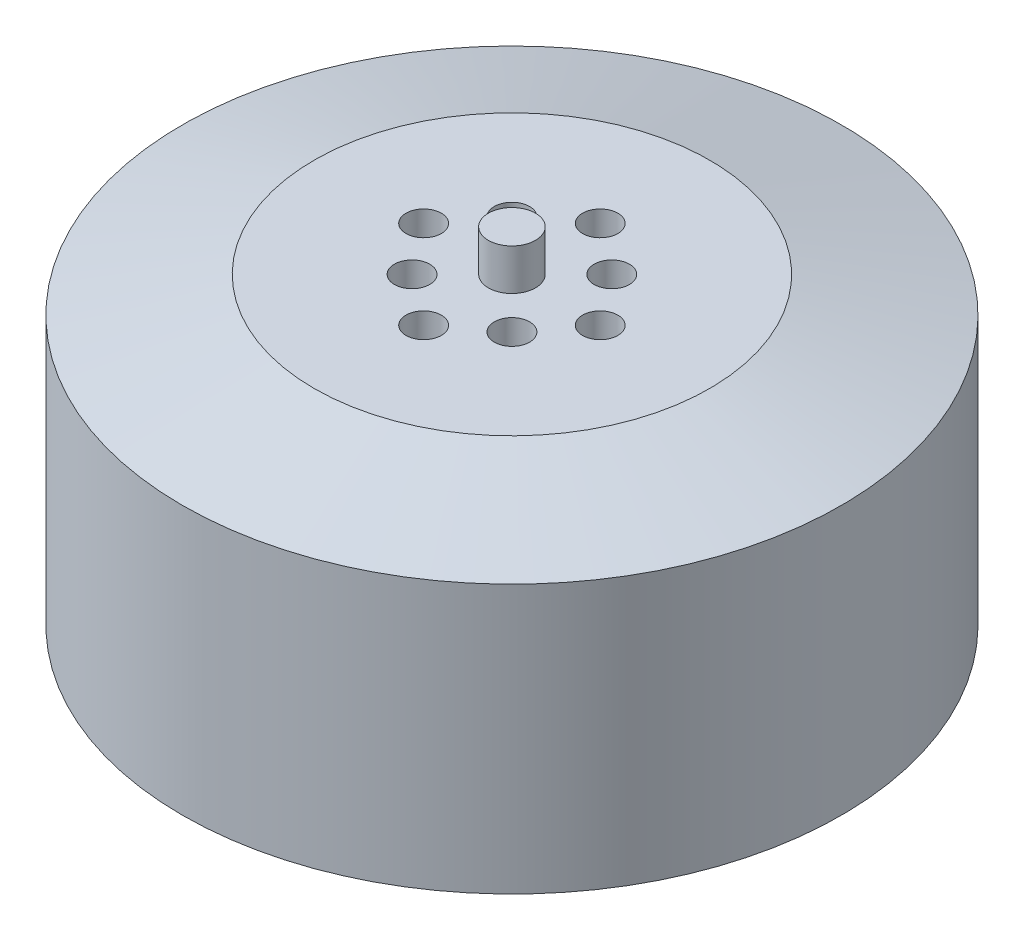
ISO-10303-21;
HEADER;
FILE_DESCRIPTION(('STEP AP214'),'2;1');
FILE_NAME('part.step','',(''),(''),'','','');
FILE_SCHEMA(('AUTOMOTIVE_DESIGN { 1 0 10303 214 1 1 1 1 }'));
ENDSEC;
DATA;
#1=APPLICATION_CONTEXT('core data for automotive mechanical design processes');
#2=APPLICATION_PROTOCOL_DEFINITION('international standard','automotive_design',2000,#1);
#3=PRODUCT_CONTEXT('',#1,'mechanical');
#4=PRODUCT('Part','Part','',(#3));
#5=PRODUCT_RELATED_PRODUCT_CATEGORY('part','',(#4));
#6=PRODUCT_DEFINITION_FORMATION('','',#4);
#7=PRODUCT_DEFINITION_CONTEXT('part definition',#1,'design');
#8=PRODUCT_DEFINITION('design','',#6,#7);
#9=PRODUCT_DEFINITION_SHAPE('','',#8);
#10=(LENGTH_UNIT() NAMED_UNIT(*) SI_UNIT(.MILLI.,.METRE.));
#11=(NAMED_UNIT(*) PLANE_ANGLE_UNIT() SI_UNIT($,.RADIAN.));
#12=(NAMED_UNIT(*) SI_UNIT($,.STERADIAN.) SOLID_ANGLE_UNIT());
#13=UNCERTAINTY_MEASURE_WITH_UNIT(LENGTH_MEASURE(1.E-05),#10,'distance_accuracy_value','');
#14=(GEOMETRIC_REPRESENTATION_CONTEXT(3) GLOBAL_UNCERTAINTY_ASSIGNED_CONTEXT((#13)) GLOBAL_UNIT_ASSIGNED_CONTEXT((#10,
#11,#12)) REPRESENTATION_CONTEXT('',''));
#15=CARTESIAN_POINT('',(0.,0.,0.));
#16=DIRECTION('',(0.,0.,1.));
#17=DIRECTION('',(1.,0.,0.));
#18=AXIS2_PLACEMENT_3D('',#15,#16,#17);
#19=CARTESIAN_POINT('',(0.,25.8,0.));
#20=DIRECTION('',(0.,-1.,0.));
#21=DIRECTION('',(0.,0.,-1.));
#22=AXIS2_PLACEMENT_3D('',#19,#20,#21);
#23=CYLINDRICAL_SURFACE('',#22,28.);
#24=CARTESIAN_POINT('',(0.,22.8,0.));
#25=DIRECTION('',(0.,1.,0.));
#26=DIRECTION('',(0.,0.,1.));
#27=AXIS2_PLACEMENT_3D('',#24,#25,#26);
#28=CIRCLE('',#27,28.);
#29=CARTESIAN_POINT('',(0.,22.8,28.));
#30=VERTEX_POINT('',#29);
#31=EDGE_CURVE('E10',#30,#30,#28,.F.);
#32=ORIENTED_EDGE('',*,*,#31,.T.);
#33=EDGE_LOOP('',(#32));
#34=FACE_BOUND('',#33,.T.);
#35=CARTESIAN_POINT('',(0.,0.,0.));
#36=DIRECTION('',(0.,1.,0.));
#37=DIRECTION('',(0.,0.,1.));
#38=AXIS2_PLACEMENT_3D('',#35,#36,#37);
#39=CIRCLE('',#38,28.);
#40=CARTESIAN_POINT('',(0.,0.,28.));
#41=VERTEX_POINT('',#40);
#42=EDGE_CURVE('E43',#41,#41,#39,.T.);
#43=ORIENTED_EDGE('',*,*,#42,.T.);
#44=EDGE_LOOP('',(#43));
#45=FACE_BOUND('',#44,.T.);
#46=ADVANCED_FACE('F32',(#34,#45),#23,.T.);
#47=CARTESIAN_POINT('',(0.,25.8,0.));
#48=DIRECTION('',(0.,1.,0.));
#49=DIRECTION('',(0.,0.,1.));
#50=AXIS2_PLACEMENT_3D('',#47,#48,#49);
#51=PLANE('',#50);
#52=CARTESIAN_POINT('',(0.,25.8,0.));
#53=DIRECTION('',(0.,1.,0.));
#54=DIRECTION('',(0.,0.,1.));
#55=AXIS2_PLACEMENT_3D('',#52,#53,#54);
#56=CIRCLE('',#55,16.8038475772934);
#57=CARTESIAN_POINT('',(0.,25.8,16.8038475772934));
#58=VERTEX_POINT('',#57);
#59=EDGE_CURVE('E39',#58,#58,#56,.T.);
#60=ORIENTED_EDGE('',*,*,#59,.T.);
#61=EDGE_LOOP('',(#60));
#62=FACE_BOUND('',#61,.T.);
#63=CARTESIAN_POINT('',(-7.5,25.8,0.));
#64=DIRECTION('',(0.,1.,0.));
#65=DIRECTION('',(0.,0.,1.));
#66=AXIS2_PLACEMENT_3D('',#63,#64,#65);
#67=CIRCLE('',#66,1.50000000000008);
#68=CARTESIAN_POINT('',(-7.5,25.8,1.50000000000008));
#69=VERTEX_POINT('',#68);
#70=EDGE_CURVE('E111',#69,#69,#67,.T.);
#71=ORIENTED_EDGE('',*,*,#70,.F.);
#72=EDGE_LOOP('',(#71));
#73=FACE_BOUND('',#72,.T.);
#74=CARTESIAN_POINT('',(4.24264068711953,25.8,4.24264068711928));
#75=DIRECTION('',(0.,1.,0.));
#76=DIRECTION('',(0.,0.,1.));
#77=AXIS2_PLACEMENT_3D('',#74,#75,#76);
#78=CIRCLE('',#77,1.49999999999994);
#79=CARTESIAN_POINT('',(4.24264068711953,25.8,5.74264068711922));
#80=VERTEX_POINT('',#79);
#81=EDGE_CURVE('E104',#80,#80,#78,.T.);
#82=ORIENTED_EDGE('',*,*,#81,.F.);
#83=EDGE_LOOP('',(#82));
#84=FACE_BOUND('',#83,.T.);
#85=CARTESIAN_POINT('',(-4.24264068711904,25.8,4.24264068711953));
#86=DIRECTION('',(0.,1.,0.));
#87=DIRECTION('',(0.,0.,1.));
#88=AXIS2_PLACEMENT_3D('',#85,#86,#87);
#89=CIRCLE('',#88,1.50000000000017);
#90=CARTESIAN_POINT('',(-4.24264068711904,25.8,5.7426406871197));
#91=VERTEX_POINT('',#90);
#92=EDGE_CURVE('E122',#91,#91,#89,.T.);
#93=ORIENTED_EDGE('',*,*,#92,.F.);
#94=EDGE_LOOP('',(#93));
#95=FACE_BOUND('',#94,.T.);
#96=CARTESIAN_POINT('',(-4.2426406871193,25.8,-4.24264068711904));
#97=DIRECTION('',(0.,1.,0.));
#98=DIRECTION('',(0.,0.,1.));
#99=AXIS2_PLACEMENT_3D('',#96,#97,#98);
#100=CIRCLE('',#99,1.50000000000025);
#101=CARTESIAN_POINT('',(-4.2426406871193,25.8,-2.74264068711879));
#102=VERTEX_POINT('',#101);
#103=EDGE_CURVE('E116',#102,#102,#100,.T.);
#104=ORIENTED_EDGE('',*,*,#103,.F.);
#105=EDGE_LOOP('',(#104));
#106=FACE_BOUND('',#105,.T.);
#107=CARTESIAN_POINT('',(0.,25.8,7.5));
#108=DIRECTION('',(0.,1.,0.));
#109=DIRECTION('',(0.,0.,1.));
#110=AXIS2_PLACEMENT_3D('',#107,#108,#109);
#111=CIRCLE('',#110,1.50000000000005);
#112=CARTESIAN_POINT('',(0.,25.8,9.00000000000005));
#113=VERTEX_POINT('',#112);
#114=EDGE_CURVE('E86',#113,#113,#111,.T.);
#115=ORIENTED_EDGE('',*,*,#114,.F.);
#116=EDGE_LOOP('',(#115));
#117=FACE_BOUND('',#116,.T.);
#118=CARTESIAN_POINT('',(7.5,25.8,0.));
#119=DIRECTION('',(0.,1.,0.));
#120=DIRECTION('',(0.,0.,1.));
#121=AXIS2_PLACEMENT_3D('',#118,#119,#120);
#122=CIRCLE('',#121,1.50000000000002);
#123=CARTESIAN_POINT('',(7.5,25.8,1.50000000000002));
#124=VERTEX_POINT('',#123);
#125=EDGE_CURVE('E93',#124,#124,#122,.T.);
#126=ORIENTED_EDGE('',*,*,#125,.F.);
#127=EDGE_LOOP('',(#126));
#128=FACE_BOUND('',#127,.T.);
#129=CARTESIAN_POINT('',(4.24264068711928,25.8,-4.24264068711929));
#130=DIRECTION('',(0.,1.,0.));
#131=DIRECTION('',(0.,0.,1.));
#132=AXIS2_PLACEMENT_3D('',#129,#130,#131);
#133=CIRCLE('',#132,1.5);
#134=CARTESIAN_POINT('',(4.24264068711928,25.8,-2.74264068711929));
#135=VERTEX_POINT('',#134);
#136=EDGE_CURVE('E99',#135,#135,#133,.T.);
#137=ORIENTED_EDGE('',*,*,#136,.F.);
#138=EDGE_LOOP('',(#137));
#139=FACE_BOUND('',#138,.T.);
#140=CARTESIAN_POINT('',(0.,25.8,-7.5));
#141=DIRECTION('',(0.,1.,0.));
#142=DIRECTION('',(0.,0.,1.));
#143=AXIS2_PLACEMENT_3D('',#140,#141,#142);
#144=CIRCLE('',#143,1.5);
#145=CARTESIAN_POINT('',(0.,25.8,-6.));
#146=VERTEX_POINT('',#145);
#147=EDGE_CURVE('E80',#146,#146,#144,.T.);
#148=ORIENTED_EDGE('',*,*,#147,.F.);
#149=EDGE_LOOP('',(#148));
#150=FACE_BOUND('',#149,.T.);
#151=CARTESIAN_POINT('',(0.,25.8,0.));
#152=DIRECTION('',(0.,1.,0.));
#153=DIRECTION('',(0.,0.,1.));
#154=AXIS2_PLACEMENT_3D('',#151,#152,#153);
#155=CIRCLE('',#154,2.);
#156=CARTESIAN_POINT('',(0.,25.8,2.));
#157=VERTEX_POINT('',#156);
#158=EDGE_CURVE('E50',#157,#157,#155,.T.);
#159=ORIENTED_EDGE('',*,*,#158,.F.);
#160=EDGE_LOOP('',(#159));
#161=FACE_BOUND('',#160,.T.);
#162=ADVANCED_FACE('F137',(#62,#73,#84,#95,#106,#117,#128,#139,#150,#161),#51,.T.);
#163=CARTESIAN_POINT('',(0.,0.,0.));
#164=DIRECTION('',(0.,1.,0.));
#165=DIRECTION('',(0.,0.,1.));
#166=AXIS2_PLACEMENT_3D('',#163,#164,#165);
#167=PLANE('',#166);
#168=CARTESIAN_POINT('',(15.0000000000004,0.,4.24488671257339E-13));
#169=DIRECTION('',(0.,-1.,0.));
#170=DIRECTION('',(0.,0.,-1.));
#171=AXIS2_PLACEMENT_3D('',#168,#169,#170);
#172=CIRCLE('',#171,1.50000000000033);
#173=CARTESIAN_POINT('',(15.0000000000004,0.,-1.49999999999991));
#174=VERTEX_POINT('',#173);
#175=EDGE_CURVE('E75',#174,#174,#172,.T.);
#176=ORIENTED_EDGE('',*,*,#175,.F.);
#177=EDGE_LOOP('',(#176));
#178=FACE_BOUND('',#177,.T.);
#179=CARTESIAN_POINT('',(8.48977342514678E-13,0.,-15.));
#180=DIRECTION('',(0.,-1.,0.));
#181=DIRECTION('',(0.,0.,-1.));
#182=AXIS2_PLACEMENT_3D('',#179,#180,#181);
#183=CIRCLE('',#182,1.50000000000091);
#184=CARTESIAN_POINT('',(8.48977342514678E-13,0.,-16.5000000000009));
#185=VERTEX_POINT('',#184);
#186=EDGE_CURVE('E69',#185,#185,#183,.T.);
#187=ORIENTED_EDGE('',*,*,#186,.F.);
#188=EDGE_LOOP('',(#187));
#189=FACE_BOUND('',#188,.T.);
#190=CARTESIAN_POINT('',(-14.9999999999996,0.,-4.2632564145606E-13));
#191=DIRECTION('',(0.,-1.,0.));
#192=DIRECTION('',(0.,0.,-1.));
#193=AXIS2_PLACEMENT_3D('',#190,#191,#192);
#194=CIRCLE('',#193,1.50000000000068);
#195=CARTESIAN_POINT('',(-14.9999999999996,0.,-1.50000000000111));
#196=VERTEX_POINT('',#195);
#197=EDGE_CURVE('E62',#196,#196,#194,.T.);
#198=ORIENTED_EDGE('',*,*,#197,.F.);
#199=EDGE_LOOP('',(#198));
#200=FACE_BOUND('',#199,.T.);
#201=CARTESIAN_POINT('',(0.,0.,15.));
#202=DIRECTION('',(0.,-1.,0.));
#203=DIRECTION('',(0.,0.,-1.));
#204=AXIS2_PLACEMENT_3D('',#201,#202,#203);
#205=CIRCLE('',#204,1.5);
#206=CARTESIAN_POINT('',(0.,0.,13.5));
#207=VERTEX_POINT('',#206);
#208=EDGE_CURVE('E56',#207,#207,#205,.T.);
#209=ORIENTED_EDGE('',*,*,#208,.F.);
#210=EDGE_LOOP('',(#209));
#211=FACE_BOUND('',#210,.T.);
#212=ORIENTED_EDGE('',*,*,#42,.F.);
#213=EDGE_LOOP('',(#212));
#214=FACE_BOUND('',#213,.T.);
#215=ADVANCED_FACE('F140',(#178,#189,#200,#211,#214),#167,.F.);
#216=CARTESIAN_POINT('',(0.,29.3,0.));
#217=DIRECTION('',(0.,-1.,0.));
#218=DIRECTION('',(0.,0.,-1.));
#219=AXIS2_PLACEMENT_3D('',#216,#217,#218);
#220=CYLINDRICAL_SURFACE('',#219,2.);
#221=CARTESIAN_POINT('',(0.,29.3,0.));
#222=DIRECTION('',(0.,1.,0.));
#223=DIRECTION('',(0.,0.,1.));
#224=AXIS2_PLACEMENT_3D('',#221,#222,#223);
#225=CIRCLE('',#224,2.);
#226=CARTESIAN_POINT('',(0.,29.3,2.));
#227=VERTEX_POINT('',#226);
#228=EDGE_CURVE('E47',#227,#227,#225,.T.);
#229=ORIENTED_EDGE('',*,*,#228,.F.);
#230=EDGE_LOOP('',(#229));
#231=FACE_BOUND('',#230,.T.);
#232=ORIENTED_EDGE('',*,*,#158,.T.);
#233=EDGE_LOOP('',(#232));
#234=FACE_BOUND('',#233,.T.);
#235=ADVANCED_FACE('F154',(#231,#234),#220,.T.);
#236=CARTESIAN_POINT('',(0.,29.3,0.));
#237=DIRECTION('',(0.,1.,0.));
#238=DIRECTION('',(0.,0.,1.));
#239=AXIS2_PLACEMENT_3D('',#236,#237,#238);
#240=PLANE('',#239);
#241=ORIENTED_EDGE('',*,*,#228,.T.);
#242=EDGE_LOOP('',(#241));
#243=FACE_BOUND('',#242,.T.);
#244=ADVANCED_FACE('F156',(#243),#240,.T.);
#245=CARTESIAN_POINT('',(0.,3.,15.));
#246=DIRECTION('',(0.,-1.,0.));
#247=DIRECTION('',(0.,0.,-1.));
#248=AXIS2_PLACEMENT_3D('',#245,#246,#247);
#249=CYLINDRICAL_SURFACE('',#248,1.5);
#250=CARTESIAN_POINT('',(0.,3.,15.));
#251=DIRECTION('',(0.,-1.,0.));
#252=DIRECTION('',(0.,0.,-1.));
#253=AXIS2_PLACEMENT_3D('',#250,#251,#252);
#254=CIRCLE('',#253,1.5);
#255=CARTESIAN_POINT('',(0.,3.,13.5));
#256=VERTEX_POINT('',#255);
#257=EDGE_CURVE('E53',#256,#256,#254,.T.);
#258=ORIENTED_EDGE('',*,*,#257,.F.);
#259=EDGE_LOOP('',(#258));
#260=FACE_BOUND('',#259,.T.);
#261=ORIENTED_EDGE('',*,*,#208,.T.);
#262=EDGE_LOOP('',(#261));
#263=FACE_BOUND('',#262,.T.);
#264=ADVANCED_FACE('F163',(#260,#263),#249,.F.);
#265=CARTESIAN_POINT('',(0.,3.,15.));
#266=DIRECTION('',(0.,-1.,0.));
#267=DIRECTION('',(0.,0.,-1.));
#268=AXIS2_PLACEMENT_3D('',#265,#266,#267);
#269=PLANE('',#268);
#270=ORIENTED_EDGE('',*,*,#257,.T.);
#271=EDGE_LOOP('',(#270));
#272=FACE_BOUND('',#271,.T.);
#273=ADVANCED_FACE('F198',(#272),#269,.T.);
#274=CARTESIAN_POINT('',(-14.9999999999996,3.,-4.2632564145606E-13));
#275=DIRECTION('',(0.,-1.,0.));
#276=DIRECTION('',(0.,0.,-1.));
#277=AXIS2_PLACEMENT_3D('',#274,#275,#276);
#278=CYLINDRICAL_SURFACE('',#277,1.50000000000068);
#279=CARTESIAN_POINT('',(-14.9999999999996,3.,-4.2632564145606E-13));
#280=DIRECTION('',(0.,-1.,0.));
#281=DIRECTION('',(0.,0.,-1.));
#282=AXIS2_PLACEMENT_3D('',#279,#280,#281);
#283=CIRCLE('',#282,1.50000000000068);
#284=CARTESIAN_POINT('',(-14.9999999999996,3.,-1.50000000000111));
#285=VERTEX_POINT('',#284);
#286=EDGE_CURVE('E65',#285,#285,#283,.T.);
#287=ORIENTED_EDGE('',*,*,#286,.F.);
#288=EDGE_LOOP('',(#287));
#289=FACE_BOUND('',#288,.T.);
#290=ORIENTED_EDGE('',*,*,#197,.T.);
#291=EDGE_LOOP('',(#290));
#292=FACE_BOUND('',#291,.T.);
#293=ADVANCED_FACE('F208',(#289,#292),#278,.F.);
#294=CARTESIAN_POINT('',(-14.9999999999996,3.,-4.2632564145606E-13));
#295=DIRECTION('',(0.,-1.,0.));
#296=DIRECTION('',(0.,0.,-1.));
#297=AXIS2_PLACEMENT_3D('',#294,#295,#296);
#298=PLANE('',#297);
#299=ORIENTED_EDGE('',*,*,#286,.T.);
#300=EDGE_LOOP('',(#299));
#301=FACE_BOUND('',#300,.T.);
#302=ADVANCED_FACE('F218',(#301),#298,.T.);
#303=CARTESIAN_POINT('',(8.48977342514678E-13,3.,-15.));
#304=DIRECTION('',(0.,-1.,0.));
#305=DIRECTION('',(0.,0.,-1.));
#306=AXIS2_PLACEMENT_3D('',#303,#304,#305);
#307=CYLINDRICAL_SURFACE('',#306,1.50000000000091);
#308=CARTESIAN_POINT('',(8.48977342514678E-13,3.,-15.));
#309=DIRECTION('',(0.,-1.,0.));
#310=DIRECTION('',(0.,0.,-1.));
#311=AXIS2_PLACEMENT_3D('',#308,#309,#310);
#312=CIRCLE('',#311,1.50000000000091);
#313=CARTESIAN_POINT('',(8.48977342514678E-13,3.,-16.5000000000009));
#314=VERTEX_POINT('',#313);
#315=EDGE_CURVE('E72',#314,#314,#312,.T.);
#316=ORIENTED_EDGE('',*,*,#315,.F.);
#317=EDGE_LOOP('',(#316));
#318=FACE_BOUND('',#317,.T.);
#319=ORIENTED_EDGE('',*,*,#186,.T.);
#320=EDGE_LOOP('',(#319));
#321=FACE_BOUND('',#320,.T.);
#322=ADVANCED_FACE('F228',(#318,#321),#307,.F.);
#323=CARTESIAN_POINT('',(8.48977342514678E-13,3.,-15.));
#324=DIRECTION('',(0.,-1.,0.));
#325=DIRECTION('',(0.,0.,-1.));
#326=AXIS2_PLACEMENT_3D('',#323,#324,#325);
#327=PLANE('',#326);
#328=ORIENTED_EDGE('',*,*,#315,.T.);
#329=EDGE_LOOP('',(#328));
#330=FACE_BOUND('',#329,.T.);
#331=ADVANCED_FACE('F238',(#330),#327,.T.);
#332=CARTESIAN_POINT('',(15.0000000000004,3.,4.24488671257339E-13));
#333=DIRECTION('',(0.,-1.,0.));
#334=DIRECTION('',(0.,0.,-1.));
#335=AXIS2_PLACEMENT_3D('',#332,#333,#334);
#336=CYLINDRICAL_SURFACE('',#335,1.50000000000033);
#337=CARTESIAN_POINT('',(15.0000000000004,3.,4.24488671257339E-13));
#338=DIRECTION('',(0.,-1.,0.));
#339=DIRECTION('',(0.,0.,-1.));
#340=AXIS2_PLACEMENT_3D('',#337,#338,#339);
#341=CIRCLE('',#340,1.50000000000033);
#342=CARTESIAN_POINT('',(15.0000000000004,3.,-1.49999999999991));
#343=VERTEX_POINT('',#342);
#344=EDGE_CURVE('E59',#343,#343,#341,.T.);
#345=ORIENTED_EDGE('',*,*,#344,.F.);
#346=EDGE_LOOP('',(#345));
#347=FACE_BOUND('',#346,.T.);
#348=ORIENTED_EDGE('',*,*,#175,.T.);
#349=EDGE_LOOP('',(#348));
#350=FACE_BOUND('',#349,.T.);
#351=ADVANCED_FACE('F248',(#347,#350),#336,.F.);
#352=CARTESIAN_POINT('',(15.0000000000004,3.,4.24488671257339E-13));
#353=DIRECTION('',(0.,-1.,0.));
#354=DIRECTION('',(0.,0.,-1.));
#355=AXIS2_PLACEMENT_3D('',#352,#353,#354);
#356=PLANE('',#355);
#357=ORIENTED_EDGE('',*,*,#344,.T.);
#358=EDGE_LOOP('',(#357));
#359=FACE_BOUND('',#358,.T.);
#360=ADVANCED_FACE('F258',(#359),#356,.T.);
#361=CARTESIAN_POINT('',(0.,22.8,-7.5));
#362=DIRECTION('',(0.,1.,0.));
#363=DIRECTION('',(0.,0.,1.));
#364=AXIS2_PLACEMENT_3D('',#361,#362,#363);
#365=CYLINDRICAL_SURFACE('',#364,1.5);
#366=CARTESIAN_POINT('',(0.,22.8,-7.5));
#367=DIRECTION('',(0.,1.,0.));
#368=DIRECTION('',(0.,0.,1.));
#369=AXIS2_PLACEMENT_3D('',#366,#367,#368);
#370=CIRCLE('',#369,1.5);
#371=CARTESIAN_POINT('',(0.,22.8,-6.));
#372=VERTEX_POINT('',#371);
#373=EDGE_CURVE('E66',#372,#372,#370,.T.);
#374=ORIENTED_EDGE('',*,*,#373,.F.);
#375=EDGE_LOOP('',(#374));
#376=FACE_BOUND('',#375,.T.);
#377=ORIENTED_EDGE('',*,*,#147,.T.);
#378=EDGE_LOOP('',(#377));
#379=FACE_BOUND('',#378,.T.);
#380=ADVANCED_FACE('F268',(#376,#379),#365,.F.);
#381=CARTESIAN_POINT('',(0.,22.8,-7.5));
#382=DIRECTION('',(0.,1.,0.));
#383=DIRECTION('',(0.,0.,1.));
#384=AXIS2_PLACEMENT_3D('',#381,#382,#383);
#385=PLANE('',#384);
#386=ORIENTED_EDGE('',*,*,#373,.T.);
#387=EDGE_LOOP('',(#386));
#388=FACE_BOUND('',#387,.T.);
#389=ADVANCED_FACE('F278',(#388),#385,.T.);
#390=CARTESIAN_POINT('',(4.24264068711928,22.8,-4.24264068711929));
#391=DIRECTION('',(0.,1.,0.));
#392=DIRECTION('',(0.,0.,1.));
#393=AXIS2_PLACEMENT_3D('',#390,#391,#392);
#394=CYLINDRICAL_SURFACE('',#393,1.5);
#395=CARTESIAN_POINT('',(4.24264068711928,22.8,-4.24264068711929));
#396=DIRECTION('',(0.,1.,0.));
#397=DIRECTION('',(0.,0.,1.));
#398=AXIS2_PLACEMENT_3D('',#395,#396,#397);
#399=CIRCLE('',#398,1.5);
#400=CARTESIAN_POINT('',(4.24264068711928,22.8,-2.74264068711929));
#401=VERTEX_POINT('',#400);
#402=EDGE_CURVE('E83',#401,#401,#399,.T.);
#403=ORIENTED_EDGE('',*,*,#402,.F.);
#404=EDGE_LOOP('',(#403));
#405=FACE_BOUND('',#404,.T.);
#406=ORIENTED_EDGE('',*,*,#136,.T.);
#407=EDGE_LOOP('',(#406));
#408=FACE_BOUND('',#407,.T.);
#409=ADVANCED_FACE('F288',(#405,#408),#394,.F.);
#410=CARTESIAN_POINT('',(4.24264068711928,22.8,-4.24264068711929));
#411=DIRECTION('',(0.,1.,0.));
#412=DIRECTION('',(0.,0.,1.));
#413=AXIS2_PLACEMENT_3D('',#410,#411,#412);
#414=PLANE('',#413);
#415=ORIENTED_EDGE('',*,*,#402,.T.);
#416=EDGE_LOOP('',(#415));
#417=FACE_BOUND('',#416,.T.);
#418=ADVANCED_FACE('F298',(#417),#414,.T.);
#419=CARTESIAN_POINT('',(7.5,22.8,0.));
#420=DIRECTION('',(0.,1.,0.));
#421=DIRECTION('',(0.,0.,1.));
#422=AXIS2_PLACEMENT_3D('',#419,#420,#421);
#423=CYLINDRICAL_SURFACE('',#422,1.50000000000002);
#424=CARTESIAN_POINT('',(7.5,22.8,0.));
#425=DIRECTION('',(0.,1.,0.));
#426=DIRECTION('',(0.,0.,1.));
#427=AXIS2_PLACEMENT_3D('',#424,#425,#426);
#428=CIRCLE('',#427,1.50000000000002);
#429=CARTESIAN_POINT('',(7.5,22.8,1.50000000000002));
#430=VERTEX_POINT('',#429);
#431=EDGE_CURVE('E96',#430,#430,#428,.T.);
#432=ORIENTED_EDGE('',*,*,#431,.F.);
#433=EDGE_LOOP('',(#432));
#434=FACE_BOUND('',#433,.T.);
#435=ORIENTED_EDGE('',*,*,#125,.T.);
#436=EDGE_LOOP('',(#435));
#437=FACE_BOUND('',#436,.T.);
#438=ADVANCED_FACE('F308',(#434,#437),#423,.F.);
#439=CARTESIAN_POINT('',(7.5,22.8,0.));
#440=DIRECTION('',(0.,1.,0.));
#441=DIRECTION('',(0.,0.,1.));
#442=AXIS2_PLACEMENT_3D('',#439,#440,#441);
#443=PLANE('',#442);
#444=ORIENTED_EDGE('',*,*,#431,.T.);
#445=EDGE_LOOP('',(#444));
#446=FACE_BOUND('',#445,.T.);
#447=ADVANCED_FACE('F318',(#446),#443,.T.);
#448=CARTESIAN_POINT('',(0.,22.8,7.5));
#449=DIRECTION('',(0.,1.,0.));
#450=DIRECTION('',(0.,0.,1.));
#451=AXIS2_PLACEMENT_3D('',#448,#449,#450);
#452=CYLINDRICAL_SURFACE('',#451,1.50000000000005);
#453=CARTESIAN_POINT('',(0.,22.8,7.5));
#454=DIRECTION('',(0.,1.,0.));
#455=DIRECTION('',(0.,0.,1.));
#456=AXIS2_PLACEMENT_3D('',#453,#454,#455);
#457=CIRCLE('',#456,1.50000000000005);
#458=CARTESIAN_POINT('',(0.,22.8,9.00000000000005));
#459=VERTEX_POINT('',#458);
#460=EDGE_CURVE('E89',#459,#459,#457,.T.);
#461=ORIENTED_EDGE('',*,*,#460,.F.);
#462=EDGE_LOOP('',(#461));
#463=FACE_BOUND('',#462,.T.);
#464=ORIENTED_EDGE('',*,*,#114,.T.);
#465=EDGE_LOOP('',(#464));
#466=FACE_BOUND('',#465,.T.);
#467=ADVANCED_FACE('F328',(#463,#466),#452,.F.);
#468=CARTESIAN_POINT('',(0.,22.8,7.5));
#469=DIRECTION('',(0.,1.,0.));
#470=DIRECTION('',(0.,0.,1.));
#471=AXIS2_PLACEMENT_3D('',#468,#469,#470);
#472=PLANE('',#471);
#473=ORIENTED_EDGE('',*,*,#460,.T.);
#474=EDGE_LOOP('',(#473));
#475=FACE_BOUND('',#474,.T.);
#476=ADVANCED_FACE('F338',(#475),#472,.T.);
#477=CARTESIAN_POINT('',(-4.2426406871193,22.8,-4.24264068711904));
#478=DIRECTION('',(0.,1.,0.));
#479=DIRECTION('',(0.,0.,1.));
#480=AXIS2_PLACEMENT_3D('',#477,#478,#479);
#481=CYLINDRICAL_SURFACE('',#480,1.50000000000025);
#482=CARTESIAN_POINT('',(-4.2426406871193,22.8,-4.24264068711904));
#483=DIRECTION('',(0.,1.,0.));
#484=DIRECTION('',(0.,0.,1.));
#485=AXIS2_PLACEMENT_3D('',#482,#483,#484);
#486=CIRCLE('',#485,1.50000000000025);
#487=CARTESIAN_POINT('',(-4.2426406871193,22.8,-2.74264068711879));
#488=VERTEX_POINT('',#487);
#489=EDGE_CURVE('E119',#488,#488,#486,.T.);
#490=ORIENTED_EDGE('',*,*,#489,.F.);
#491=EDGE_LOOP('',(#490));
#492=FACE_BOUND('',#491,.T.);
#493=ORIENTED_EDGE('',*,*,#103,.T.);
#494=EDGE_LOOP('',(#493));
#495=FACE_BOUND('',#494,.T.);
#496=ADVANCED_FACE('F348',(#492,#495),#481,.F.);
#497=CARTESIAN_POINT('',(-4.2426406871193,22.8,-4.24264068711904));
#498=DIRECTION('',(0.,1.,0.));
#499=DIRECTION('',(0.,0.,1.));
#500=AXIS2_PLACEMENT_3D('',#497,#498,#499);
#501=PLANE('',#500);
#502=ORIENTED_EDGE('',*,*,#489,.T.);
#503=EDGE_LOOP('',(#502));
#504=FACE_BOUND('',#503,.T.);
#505=ADVANCED_FACE('F133',(#504),#501,.T.);
#506=CARTESIAN_POINT('',(-4.24264068711904,22.8,4.24264068711953));
#507=DIRECTION('',(0.,1.,0.));
#508=DIRECTION('',(0.,0.,1.));
#509=AXIS2_PLACEMENT_3D('',#506,#507,#508);
#510=CYLINDRICAL_SURFACE('',#509,1.50000000000017);
#511=CARTESIAN_POINT('',(-4.24264068711904,22.8,4.24264068711953));
#512=DIRECTION('',(0.,1.,0.));
#513=DIRECTION('',(0.,0.,1.));
#514=AXIS2_PLACEMENT_3D('',#511,#512,#513);
#515=CIRCLE('',#514,1.50000000000017);
#516=CARTESIAN_POINT('',(-4.24264068711904,22.8,5.7426406871197));
#517=VERTEX_POINT('',#516);
#518=EDGE_CURVE('E108',#517,#517,#515,.T.);
#519=ORIENTED_EDGE('',*,*,#518,.F.);
#520=EDGE_LOOP('',(#519));
#521=FACE_BOUND('',#520,.T.);
#522=ORIENTED_EDGE('',*,*,#92,.T.);
#523=EDGE_LOOP('',(#522));
#524=FACE_BOUND('',#523,.T.);
#525=ADVANCED_FACE('F130',(#521,#524),#510,.F.);
#526=CARTESIAN_POINT('',(-4.24264068711904,22.8,4.24264068711953));
#527=DIRECTION('',(0.,1.,0.));
#528=DIRECTION('',(0.,0.,1.));
#529=AXIS2_PLACEMENT_3D('',#526,#527,#528);
#530=PLANE('',#529);
#531=ORIENTED_EDGE('',*,*,#518,.T.);
#532=EDGE_LOOP('',(#531));
#533=FACE_BOUND('',#532,.T.);
#534=ADVANCED_FACE('F128',(#533),#530,.T.);
#535=CARTESIAN_POINT('',(4.24264068711953,22.8,4.24264068711928));
#536=DIRECTION('',(0.,1.,0.));
#537=DIRECTION('',(0.,0.,1.));
#538=AXIS2_PLACEMENT_3D('',#535,#536,#537);
#539=CYLINDRICAL_SURFACE('',#538,1.49999999999994);
#540=CARTESIAN_POINT('',(4.24264068711953,22.8,4.24264068711928));
#541=DIRECTION('',(0.,1.,0.));
#542=DIRECTION('',(0.,0.,1.));
#543=AXIS2_PLACEMENT_3D('',#540,#541,#542);
#544=CIRCLE('',#543,1.49999999999994);
#545=CARTESIAN_POINT('',(4.24264068711953,22.8,5.74264068711922));
#546=VERTEX_POINT('',#545);
#547=EDGE_CURVE('E107',#546,#546,#544,.T.);
#548=ORIENTED_EDGE('',*,*,#547,.F.);
#549=EDGE_LOOP('',(#548));
#550=FACE_BOUND('',#549,.T.);
#551=ORIENTED_EDGE('',*,*,#81,.T.);
#552=EDGE_LOOP('',(#551));
#553=FACE_BOUND('',#552,.T.);
#554=ADVANCED_FACE('F382',(#550,#553),#539,.F.);
#555=CARTESIAN_POINT('',(4.24264068711953,22.8,4.24264068711928));
#556=DIRECTION('',(0.,1.,0.));
#557=DIRECTION('',(0.,0.,1.));
#558=AXIS2_PLACEMENT_3D('',#555,#556,#557);
#559=PLANE('',#558);
#560=ORIENTED_EDGE('',*,*,#547,.T.);
#561=EDGE_LOOP('',(#560));
#562=FACE_BOUND('',#561,.T.);
#563=ADVANCED_FACE('F391',(#562),#559,.T.);
#564=CARTESIAN_POINT('',(-7.5,22.8,0.));
#565=DIRECTION('',(0.,1.,0.));
#566=DIRECTION('',(0.,0.,1.));
#567=AXIS2_PLACEMENT_3D('',#564,#565,#566);
#568=CYLINDRICAL_SURFACE('',#567,1.50000000000008);
#569=CARTESIAN_POINT('',(-7.5,22.8,0.));
#570=DIRECTION('',(0.,1.,0.));
#571=DIRECTION('',(0.,0.,1.));
#572=AXIS2_PLACEMENT_3D('',#569,#570,#571);
#573=CIRCLE('',#572,1.50000000000008);
#574=CARTESIAN_POINT('',(-7.5,22.8,1.50000000000008));
#575=VERTEX_POINT('',#574);
#576=EDGE_CURVE('E90',#575,#575,#573,.T.);
#577=ORIENTED_EDGE('',*,*,#576,.F.);
#578=EDGE_LOOP('',(#577));
#579=FACE_BOUND('',#578,.T.);
#580=ORIENTED_EDGE('',*,*,#70,.T.);
#581=EDGE_LOOP('',(#580));
#582=FACE_BOUND('',#581,.T.);
#583=ADVANCED_FACE('F401',(#579,#582),#568,.F.);
#584=CARTESIAN_POINT('',(-7.5,22.8,0.));
#585=DIRECTION('',(0.,1.,0.));
#586=DIRECTION('',(0.,0.,1.));
#587=AXIS2_PLACEMENT_3D('',#584,#585,#586);
#588=PLANE('',#587);
#589=ORIENTED_EDGE('',*,*,#576,.T.);
#590=EDGE_LOOP('',(#589));
#591=FACE_BOUND('',#590,.T.);
#592=ADVANCED_FACE('F410',(#591),#588,.T.);
#593=CARTESIAN_POINT('',(0.,25.8,0.));
#594=DIRECTION('',(0.,-1.,0.));
#595=DIRECTION('',(0.,0.,-1.));
#596=AXIS2_PLACEMENT_3D('',#593,#594,#595);
#597=CONICAL_SURFACE('',#596,16.8038475772934,1.30899693899575);
#598=ORIENTED_EDGE('',*,*,#31,.F.);
#599=EDGE_LOOP('',(#598));
#600=FACE_BOUND('',#599,.T.);
#601=ORIENTED_EDGE('',*,*,#59,.F.);
#602=EDGE_LOOP('',(#601));
#603=FACE_BOUND('',#602,.T.);
#604=ADVANCED_FACE('F34',(#600,#603),#597,.T.);
#605=CLOSED_SHELL('',(#46,#162,#215,#235,#244,#264,#273,#293,#302,#322,#331,#351,#360,#380,#389,
#409,#418,#438,#447,#467,#476,#496,#505,#525,#534,#554,#563,#583,#592,#604));
#606=MANIFOLD_SOLID_BREP('B2',#605);
#607=ADVANCED_BREP_SHAPE_REPRESENTATION('',(#18,#606),#14);
#608=SHAPE_DEFINITION_REPRESENTATION(#9,#607);
ENDSEC;
END-ISO-10303-21;
